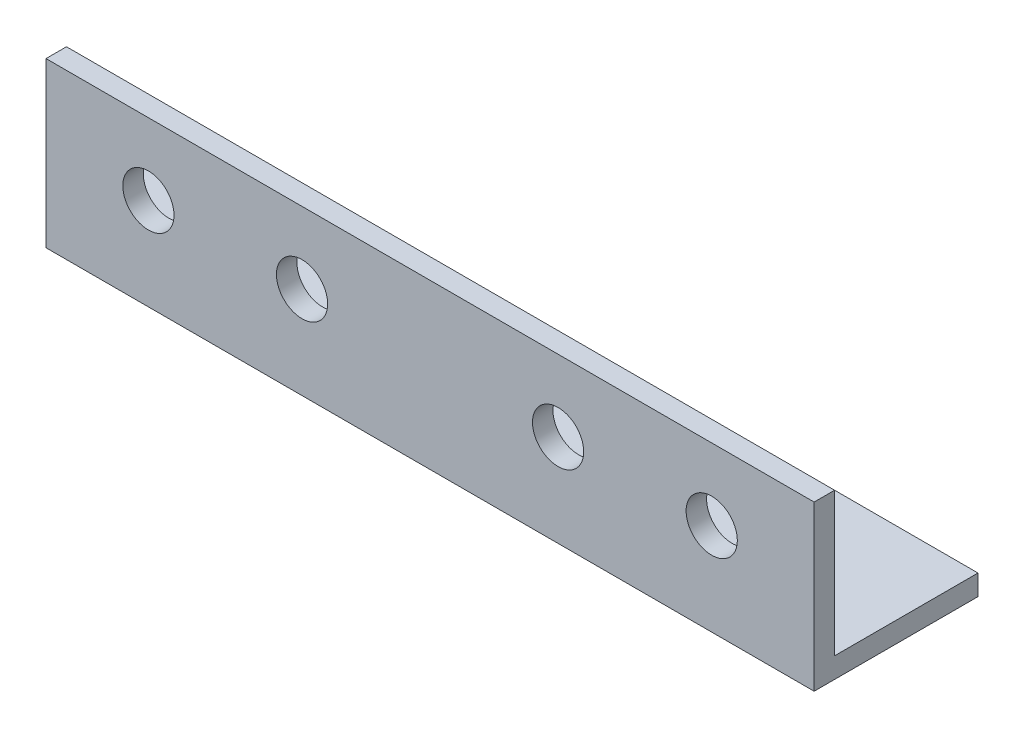
ISO-10303-21;
HEADER;
FILE_DESCRIPTION(('STEP AP214'),'2;1');
FILE_NAME('part.step','',(''),(''),'','','');
FILE_SCHEMA(('AUTOMOTIVE_DESIGN { 1 0 10303 214 1 1 1 1 }'));
ENDSEC;
DATA;
#1=APPLICATION_CONTEXT('core data for automotive mechanical design processes');
#2=APPLICATION_PROTOCOL_DEFINITION('international standard','automotive_design',2000,#1);
#3=PRODUCT_CONTEXT('',#1,'mechanical');
#4=PRODUCT('Part','Part','',(#3));
#5=PRODUCT_RELATED_PRODUCT_CATEGORY('part','',(#4));
#6=PRODUCT_DEFINITION_FORMATION('','',#4);
#7=PRODUCT_DEFINITION_CONTEXT('part definition',#1,'design');
#8=PRODUCT_DEFINITION('design','',#6,#7);
#9=PRODUCT_DEFINITION_SHAPE('','',#8);
#10=(LENGTH_UNIT() NAMED_UNIT(*) SI_UNIT(.MILLI.,.METRE.));
#11=(NAMED_UNIT(*) PLANE_ANGLE_UNIT() SI_UNIT($,.RADIAN.));
#12=(NAMED_UNIT(*) SI_UNIT($,.STERADIAN.) SOLID_ANGLE_UNIT());
#13=UNCERTAINTY_MEASURE_WITH_UNIT(LENGTH_MEASURE(1.E-05),#10,'distance_accuracy_value','');
#14=(GEOMETRIC_REPRESENTATION_CONTEXT(3) GLOBAL_UNCERTAINTY_ASSIGNED_CONTEXT((#13)) GLOBAL_UNIT_ASSIGNED_CONTEXT((#10,
#11,#12)) REPRESENTATION_CONTEXT('',''));
#15=CARTESIAN_POINT('',(0.,0.,0.));
#16=DIRECTION('',(0.,0.,1.));
#17=DIRECTION('',(1.,0.,0.));
#18=AXIS2_PLACEMENT_3D('',#15,#16,#17);
#19=CARTESIAN_POINT('',(150.,0.,0.));
#20=DIRECTION('',(0.,1.,0.));
#21=DIRECTION('',(0.,0.,1.));
#22=AXIS2_PLACEMENT_3D('',#19,#20,#21);
#23=PLANE('',#22);
#24=DIRECTION('',(0.,0.,-1.));
#25=VECTOR('',#24,1.);
#26=CARTESIAN_POINT('',(0.,0.,0.));
#27=LINE('',#26,#25);
#28=CARTESIAN_POINT('',(0.,0.,0.));
#29=VERTEX_POINT('',#28);
#30=CARTESIAN_POINT('',(0.,0.,-32.));
#31=VERTEX_POINT('',#30);
#32=EDGE_CURVE('E115',#29,#31,#27,.T.);
#33=ORIENTED_EDGE('',*,*,#32,.T.);
#34=DIRECTION('',(-1.,0.,0.));
#35=VECTOR('',#34,1.);
#36=CARTESIAN_POINT('',(150.,0.,-32.));
#37=LINE('',#36,#35);
#38=CARTESIAN_POINT('',(150.,0.,-32.));
#39=VERTEX_POINT('',#38);
#40=EDGE_CURVE('E11',#39,#31,#37,.T.);
#41=ORIENTED_EDGE('',*,*,#40,.F.);
#42=DIRECTION('',(0.,0.,-1.));
#43=VECTOR('',#42,1.);
#44=CARTESIAN_POINT('',(150.,0.,0.));
#45=LINE('',#44,#43);
#46=CARTESIAN_POINT('',(150.,0.,0.));
#47=VERTEX_POINT('',#46);
#48=EDGE_CURVE('E80',#47,#39,#45,.T.);
#49=ORIENTED_EDGE('',*,*,#48,.F.);
#50=DIRECTION('',(-1.,0.,0.));
#51=VECTOR('',#50,1.);
#52=CARTESIAN_POINT('',(150.,0.,0.));
#53=LINE('',#52,#51);
#54=EDGE_CURVE('E111',#47,#29,#53,.T.);
#55=ORIENTED_EDGE('',*,*,#54,.T.);
#56=EDGE_LOOP('',(#33,#41,#49,#55));
#57=FACE_BOUND('',#56,.T.);
#58=ADVANCED_FACE('F34',(#57),#23,.F.);
#59=CARTESIAN_POINT('',(150.,4.,-32.));
#60=DIRECTION('',(0.,0.,-1.));
#61=DIRECTION('',(-1.,0.,0.));
#62=AXIS2_PLACEMENT_3D('',#59,#60,#61);
#63=PLANE('',#62);
#64=DIRECTION('',(0.,-1.,0.));
#65=VECTOR('',#64,1.);
#66=CARTESIAN_POINT('',(0.,4.,-32.));
#67=LINE('',#66,#65);
#68=CARTESIAN_POINT('',(0.,4.,-32.));
#69=VERTEX_POINT('',#68);
#70=EDGE_CURVE('E118',#69,#31,#67,.T.);
#71=ORIENTED_EDGE('',*,*,#70,.F.);
#72=DIRECTION('',(-1.,0.,0.));
#73=VECTOR('',#72,1.);
#74=CARTESIAN_POINT('',(150.,4.,-32.));
#75=LINE('',#74,#73);
#76=CARTESIAN_POINT('',(150.,4.,-32.));
#77=VERTEX_POINT('',#76);
#78=EDGE_CURVE('E42',#77,#69,#75,.T.);
#79=ORIENTED_EDGE('',*,*,#78,.F.);
#80=DIRECTION('',(0.,-1.,0.));
#81=VECTOR('',#80,1.);
#82=CARTESIAN_POINT('',(150.,4.,-32.));
#83=LINE('',#82,#81);
#84=EDGE_CURVE('E193',#77,#39,#83,.T.);
#85=ORIENTED_EDGE('',*,*,#84,.T.);
#86=ORIENTED_EDGE('',*,*,#40,.T.);
#87=EDGE_LOOP('',(#71,#79,#85,#86));
#88=FACE_BOUND('',#87,.T.);
#89=ADVANCED_FACE('F137',(#88),#63,.T.);
#90=CARTESIAN_POINT('',(150.,4.,0.));
#91=DIRECTION('',(0.,1.,0.));
#92=DIRECTION('',(0.,0.,1.));
#93=AXIS2_PLACEMENT_3D('',#90,#91,#92);
#94=PLANE('',#93);
#95=DIRECTION('',(0.,0.,-1.));
#96=VECTOR('',#95,1.);
#97=CARTESIAN_POINT('',(0.,4.,0.));
#98=LINE('',#97,#96);
#99=CARTESIAN_POINT('',(0.,4.,-4.));
#100=VERTEX_POINT('',#99);
#101=EDGE_CURVE('E122',#100,#69,#98,.T.);
#102=ORIENTED_EDGE('',*,*,#101,.F.);
#103=DIRECTION('',(-1.,0.,0.));
#104=VECTOR('',#103,1.);
#105=CARTESIAN_POINT('',(150.,4.,-4.));
#106=LINE('',#105,#104);
#107=CARTESIAN_POINT('',(150.,4.,-4.));
#108=VERTEX_POINT('',#107);
#109=EDGE_CURVE('E101',#108,#100,#106,.T.);
#110=ORIENTED_EDGE('',*,*,#109,.F.);
#111=DIRECTION('',(0.,0.,-1.));
#112=VECTOR('',#111,1.);
#113=CARTESIAN_POINT('',(150.,4.,0.));
#114=LINE('',#113,#112);
#115=EDGE_CURVE('E107',#108,#77,#114,.T.);
#116=ORIENTED_EDGE('',*,*,#115,.T.);
#117=ORIENTED_EDGE('',*,*,#78,.T.);
#118=EDGE_LOOP('',(#102,#110,#116,#117));
#119=FACE_BOUND('',#118,.T.);
#120=ADVANCED_FACE('F134',(#119),#94,.T.);
#121=CARTESIAN_POINT('',(150.,32.,-4.));
#122=DIRECTION('',(0.,0.,-1.));
#123=DIRECTION('',(0.,1.,0.));
#124=AXIS2_PLACEMENT_3D('',#121,#122,#123);
#125=PLANE('',#124);
#126=CARTESIAN_POINT('',(19.9999999999986,18.,-4.));
#127=DIRECTION('',(0.,0.,-1.));
#128=DIRECTION('',(0.,-1.,0.));
#129=AXIS2_PLACEMENT_3D('',#126,#127,#128);
#130=CIRCLE('',#129,4.99999999999979);
#131=CARTESIAN_POINT('',(19.9999999999986,13.0000000000002,-4.));
#132=VERTEX_POINT('',#131);
#133=EDGE_CURVE('E171',#132,#132,#130,.T.);
#134=ORIENTED_EDGE('',*,*,#133,.F.);
#135=EDGE_LOOP('',(#134));
#136=FACE_BOUND('',#135,.T.);
#137=CARTESIAN_POINT('',(100.,18.,-4.));
#138=DIRECTION('',(0.,0.,-1.));
#139=DIRECTION('',(0.,1.,0.));
#140=AXIS2_PLACEMENT_3D('',#137,#138,#139);
#141=CIRCLE('',#140,4.99999999999999);
#142=CARTESIAN_POINT('',(100.,23.,-4.));
#143=VERTEX_POINT('',#142);
#144=EDGE_CURVE('E175',#143,#143,#141,.T.);
#145=ORIENTED_EDGE('',*,*,#144,.F.);
#146=EDGE_LOOP('',(#145));
#147=FACE_BOUND('',#146,.T.);
#148=CARTESIAN_POINT('',(49.9999999999994,18.0000000000009,-4.));
#149=DIRECTION('',(0.,0.,-1.));
#150=DIRECTION('',(0.,-1.,0.));
#151=AXIS2_PLACEMENT_3D('',#148,#149,#150);
#152=CIRCLE('',#151,4.99999999999999);
#153=CARTESIAN_POINT('',(49.9999999999994,13.0000000000009,-4.));
#154=VERTEX_POINT('',#153);
#155=EDGE_CURVE('E179',#154,#154,#152,.T.);
#156=ORIENTED_EDGE('',*,*,#155,.F.);
#157=EDGE_LOOP('',(#156));
#158=FACE_BOUND('',#157,.T.);
#159=CARTESIAN_POINT('',(130.,18.,-4.));
#160=DIRECTION('',(0.,0.,-1.));
#161=DIRECTION('',(0.,1.,0.));
#162=AXIS2_PLACEMENT_3D('',#159,#160,#161);
#163=CIRCLE('',#162,4.99999999999999);
#164=CARTESIAN_POINT('',(130.,23.,-4.));
#165=VERTEX_POINT('',#164);
#166=EDGE_CURVE('E182',#165,#165,#163,.T.);
#167=ORIENTED_EDGE('',*,*,#166,.F.);
#168=EDGE_LOOP('',(#167));
#169=FACE_BOUND('',#168,.T.);
#170=DIRECTION('',(0.,-1.,0.));
#171=VECTOR('',#170,1.);
#172=CARTESIAN_POINT('',(0.,32.,-4.));
#173=LINE('',#172,#171);
#174=CARTESIAN_POINT('',(0.,32.,-4.));
#175=VERTEX_POINT('',#174);
#176=EDGE_CURVE('E96',#175,#100,#173,.T.);
#177=ORIENTED_EDGE('',*,*,#176,.F.);
#178=DIRECTION('',(-1.,0.,0.));
#179=VECTOR('',#178,1.);
#180=CARTESIAN_POINT('',(150.,32.,-4.));
#181=LINE('',#180,#179);
#182=CARTESIAN_POINT('',(150.,32.,-4.));
#183=VERTEX_POINT('',#182);
#184=EDGE_CURVE('E91',#183,#175,#181,.T.);
#185=ORIENTED_EDGE('',*,*,#184,.F.);
#186=DIRECTION('',(0.,-1.,0.));
#187=VECTOR('',#186,1.);
#188=CARTESIAN_POINT('',(150.,32.,-4.));
#189=LINE('',#188,#187);
#190=EDGE_CURVE('E94',#183,#108,#189,.T.);
#191=ORIENTED_EDGE('',*,*,#190,.T.);
#192=ORIENTED_EDGE('',*,*,#109,.T.);
#193=EDGE_LOOP('',(#177,#185,#191,#192));
#194=FACE_BOUND('',#193,.T.);
#195=ADVANCED_FACE('F93',(#136,#147,#158,#169,#194),#125,.T.);
#196=CARTESIAN_POINT('',(150.,32.,0.));
#197=DIRECTION('',(0.,1.,0.));
#198=DIRECTION('',(0.,0.,1.));
#199=AXIS2_PLACEMENT_3D('',#196,#197,#198);
#200=PLANE('',#199);
#201=DIRECTION('',(0.,0.,-1.));
#202=VECTOR('',#201,1.);
#203=CARTESIAN_POINT('',(0.,32.,0.));
#204=LINE('',#203,#202);
#205=CARTESIAN_POINT('',(0.,32.,0.));
#206=VERTEX_POINT('',#205);
#207=EDGE_CURVE('E126',#206,#175,#204,.T.);
#208=ORIENTED_EDGE('',*,*,#207,.F.);
#209=DIRECTION('',(-1.,0.,0.));
#210=VECTOR('',#209,1.);
#211=CARTESIAN_POINT('',(150.,32.,0.));
#212=LINE('',#211,#210);
#213=CARTESIAN_POINT('',(150.,32.,0.));
#214=VERTEX_POINT('',#213);
#215=EDGE_CURVE('E71',#214,#206,#212,.T.);
#216=ORIENTED_EDGE('',*,*,#215,.F.);
#217=DIRECTION('',(0.,0.,-1.));
#218=VECTOR('',#217,1.);
#219=CARTESIAN_POINT('',(150.,32.,0.));
#220=LINE('',#219,#218);
#221=EDGE_CURVE('E105',#214,#183,#220,.T.);
#222=ORIENTED_EDGE('',*,*,#221,.T.);
#223=ORIENTED_EDGE('',*,*,#184,.T.);
#224=EDGE_LOOP('',(#208,#216,#222,#223));
#225=FACE_BOUND('',#224,.T.);
#226=ADVANCED_FACE('F109',(#225),#200,.T.);
#227=CARTESIAN_POINT('',(150.,32.,0.));
#228=DIRECTION('',(0.,0.,-1.));
#229=DIRECTION('',(0.,1.,0.));
#230=AXIS2_PLACEMENT_3D('',#227,#228,#229);
#231=PLANE('',#230);
#232=CARTESIAN_POINT('',(19.9999999999986,18.,0.));
#233=DIRECTION('',(0.,0.,-1.));
#234=DIRECTION('',(0.,-1.,0.));
#235=AXIS2_PLACEMENT_3D('',#232,#233,#234);
#236=CIRCLE('',#235,4.99999999999979);
#237=CARTESIAN_POINT('',(19.9999999999986,13.0000000000002,0.));
#238=VERTEX_POINT('',#237);
#239=EDGE_CURVE('E197',#238,#238,#236,.T.);
#240=ORIENTED_EDGE('',*,*,#239,.T.);
#241=EDGE_LOOP('',(#240));
#242=FACE_BOUND('',#241,.T.);
#243=CARTESIAN_POINT('',(100.,18.,0.));
#244=DIRECTION('',(0.,0.,-1.));
#245=DIRECTION('',(0.,1.,0.));
#246=AXIS2_PLACEMENT_3D('',#243,#244,#245);
#247=CIRCLE('',#246,4.99999999999999);
#248=CARTESIAN_POINT('',(100.,23.,0.));
#249=VERTEX_POINT('',#248);
#250=EDGE_CURVE('E194',#249,#249,#247,.T.);
#251=ORIENTED_EDGE('',*,*,#250,.T.);
#252=EDGE_LOOP('',(#251));
#253=FACE_BOUND('',#252,.T.);
#254=CARTESIAN_POINT('',(49.9999999999994,18.0000000000009,0.));
#255=DIRECTION('',(0.,0.,-1.));
#256=DIRECTION('',(0.,-1.,0.));
#257=AXIS2_PLACEMENT_3D('',#254,#255,#256);
#258=CIRCLE('',#257,4.99999999999999);
#259=CARTESIAN_POINT('',(49.9999999999994,13.0000000000009,0.));
#260=VERTEX_POINT('',#259);
#261=EDGE_CURVE('E184',#260,#260,#258,.T.);
#262=ORIENTED_EDGE('',*,*,#261,.T.);
#263=EDGE_LOOP('',(#262));
#264=FACE_BOUND('',#263,.T.);
#265=CARTESIAN_POINT('',(130.,18.,0.));
#266=DIRECTION('',(0.,0.,-1.));
#267=DIRECTION('',(0.,1.,0.));
#268=AXIS2_PLACEMENT_3D('',#265,#266,#267);
#269=CIRCLE('',#268,4.99999999999999);
#270=CARTESIAN_POINT('',(130.,23.,0.));
#271=VERTEX_POINT('',#270);
#272=EDGE_CURVE('E119',#271,#271,#269,.T.);
#273=ORIENTED_EDGE('',*,*,#272,.T.);
#274=EDGE_LOOP('',(#273));
#275=FACE_BOUND('',#274,.T.);
#276=DIRECTION('',(0.,-1.,0.));
#277=VECTOR('',#276,1.);
#278=CARTESIAN_POINT('',(0.,32.,0.));
#279=LINE('',#278,#277);
#280=EDGE_CURVE('E74',#206,#29,#279,.T.);
#281=ORIENTED_EDGE('',*,*,#280,.T.);
#282=ORIENTED_EDGE('',*,*,#54,.F.);
#283=DIRECTION('',(0.,-1.,0.));
#284=VECTOR('',#283,1.);
#285=CARTESIAN_POINT('',(150.,32.,0.));
#286=LINE('',#285,#284);
#287=EDGE_CURVE('E50',#214,#47,#286,.T.);
#288=ORIENTED_EDGE('',*,*,#287,.F.);
#289=ORIENTED_EDGE('',*,*,#215,.T.);
#290=EDGE_LOOP('',(#281,#282,#288,#289));
#291=FACE_BOUND('',#290,.T.);
#292=ADVANCED_FACE('F142',(#242,#253,#264,#275,#291),#231,.F.);
#293=CARTESIAN_POINT('',(150.,0.,0.));
#294=DIRECTION('',(-1.,0.,0.));
#295=DIRECTION('',(0.,0.,1.));
#296=AXIS2_PLACEMENT_3D('',#293,#294,#295);
#297=PLANE('',#296);
#298=ORIENTED_EDGE('',*,*,#48,.T.);
#299=ORIENTED_EDGE('',*,*,#84,.F.);
#300=ORIENTED_EDGE('',*,*,#115,.F.);
#301=ORIENTED_EDGE('',*,*,#190,.F.);
#302=ORIENTED_EDGE('',*,*,#221,.F.);
#303=ORIENTED_EDGE('',*,*,#287,.T.);
#304=EDGE_LOOP('',(#298,#299,#300,#301,#302,#303));
#305=FACE_BOUND('',#304,.T.);
#306=ADVANCED_FACE('F104',(#305),#297,.F.);
#307=CARTESIAN_POINT('',(0.,0.,0.));
#308=DIRECTION('',(-1.,0.,0.));
#309=DIRECTION('',(0.,0.,1.));
#310=AXIS2_PLACEMENT_3D('',#307,#308,#309);
#311=PLANE('',#310);
#312=ORIENTED_EDGE('',*,*,#32,.F.);
#313=ORIENTED_EDGE('',*,*,#280,.F.);
#314=ORIENTED_EDGE('',*,*,#207,.T.);
#315=ORIENTED_EDGE('',*,*,#176,.T.);
#316=ORIENTED_EDGE('',*,*,#101,.T.);
#317=ORIENTED_EDGE('',*,*,#70,.T.);
#318=EDGE_LOOP('',(#312,#313,#314,#315,#316,#317));
#319=FACE_BOUND('',#318,.T.);
#320=ADVANCED_FACE('F140',(#319),#311,.T.);
#321=CARTESIAN_POINT('',(130.,18.,0.));
#322=DIRECTION('',(0.,0.,-1.));
#323=DIRECTION('',(0.,1.,0.));
#324=AXIS2_PLACEMENT_3D('',#321,#322,#323);
#325=CYLINDRICAL_SURFACE('',#324,4.99999999999999);
#326=ORIENTED_EDGE('',*,*,#272,.F.);
#327=EDGE_LOOP('',(#326));
#328=FACE_BOUND('',#327,.T.);
#329=ORIENTED_EDGE('',*,*,#166,.T.);
#330=EDGE_LOOP('',(#329));
#331=FACE_BOUND('',#330,.T.);
#332=ADVANCED_FACE('F217',(#328,#331),#325,.F.);
#333=CARTESIAN_POINT('',(49.9999999999994,18.0000000000009,0.));
#334=DIRECTION('',(0.,0.,-1.));
#335=DIRECTION('',(0.,1.,0.));
#336=AXIS2_PLACEMENT_3D('',#333,#334,#335);
#337=CYLINDRICAL_SURFACE('',#336,4.99999999999999);
#338=ORIENTED_EDGE('',*,*,#261,.F.);
#339=EDGE_LOOP('',(#338));
#340=FACE_BOUND('',#339,.T.);
#341=ORIENTED_EDGE('',*,*,#155,.T.);
#342=EDGE_LOOP('',(#341));
#343=FACE_BOUND('',#342,.T.);
#344=ADVANCED_FACE('F211',(#340,#343),#337,.F.);
#345=CARTESIAN_POINT('',(100.,18.,0.));
#346=DIRECTION('',(0.,0.,-1.));
#347=DIRECTION('',(0.,1.,0.));
#348=AXIS2_PLACEMENT_3D('',#345,#346,#347);
#349=CYLINDRICAL_SURFACE('',#348,4.99999999999999);
#350=ORIENTED_EDGE('',*,*,#250,.F.);
#351=EDGE_LOOP('',(#350));
#352=FACE_BOUND('',#351,.T.);
#353=ORIENTED_EDGE('',*,*,#144,.T.);
#354=EDGE_LOOP('',(#353));
#355=FACE_BOUND('',#354,.T.);
#356=ADVANCED_FACE('F206',(#352,#355),#349,.F.);
#357=CARTESIAN_POINT('',(19.9999999999986,18.,0.));
#358=DIRECTION('',(0.,0.,-1.));
#359=DIRECTION('',(0.,1.,0.));
#360=AXIS2_PLACEMENT_3D('',#357,#358,#359);
#361=CYLINDRICAL_SURFACE('',#360,4.99999999999979);
#362=ORIENTED_EDGE('',*,*,#239,.F.);
#363=EDGE_LOOP('',(#362));
#364=FACE_BOUND('',#363,.T.);
#365=ORIENTED_EDGE('',*,*,#133,.T.);
#366=EDGE_LOOP('',(#365));
#367=FACE_BOUND('',#366,.T.);
#368=ADVANCED_FACE('F203',(#364,#367),#361,.F.);
#369=CLOSED_SHELL('',(#58,#89,#120,#195,#226,#292,#306,#320,#332,#344,#356,#368));
#370=MANIFOLD_SOLID_BREP('B2',#369);
#371=ADVANCED_BREP_SHAPE_REPRESENTATION('',(#18,#370),#14);
#372=SHAPE_DEFINITION_REPRESENTATION(#9,#371);
ENDSEC;
END-ISO-10303-21;
